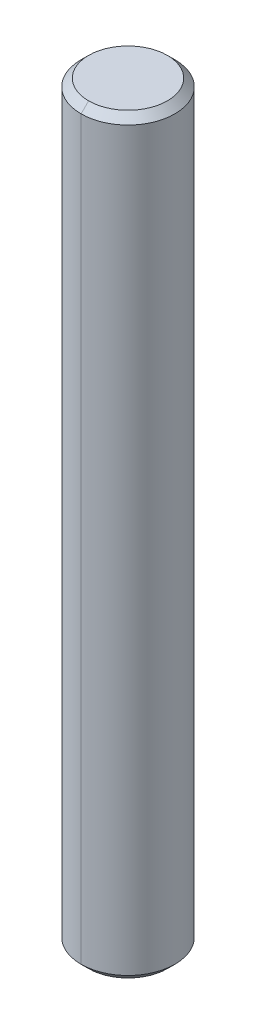
ISO-10303-21;
HEADER;
FILE_DESCRIPTION(('STEP AP214'),'2;1');
FILE_NAME('part.step','',(''),(''),'','','');
FILE_SCHEMA(('AUTOMOTIVE_DESIGN { 1 0 10303 214 1 1 1 1 }'));
ENDSEC;
DATA;
#1=APPLICATION_CONTEXT('core data for automotive mechanical design processes');
#2=APPLICATION_PROTOCOL_DEFINITION('international standard','automotive_design',2000,#1);
#3=PRODUCT_CONTEXT('',#1,'mechanical');
#4=PRODUCT('Part','Part','',(#3));
#5=PRODUCT_RELATED_PRODUCT_CATEGORY('part','',(#4));
#6=PRODUCT_DEFINITION_FORMATION('','',#4);
#7=PRODUCT_DEFINITION_CONTEXT('part definition',#1,'design');
#8=PRODUCT_DEFINITION('design','',#6,#7);
#9=PRODUCT_DEFINITION_SHAPE('','',#8);
#10=(LENGTH_UNIT() NAMED_UNIT(*) SI_UNIT(.MILLI.,.METRE.));
#11=(NAMED_UNIT(*) PLANE_ANGLE_UNIT() SI_UNIT($,.RADIAN.));
#12=(NAMED_UNIT(*) SI_UNIT($,.STERADIAN.) SOLID_ANGLE_UNIT());
#13=UNCERTAINTY_MEASURE_WITH_UNIT(LENGTH_MEASURE(1.E-05),#10,'distance_accuracy_value','');
#14=(GEOMETRIC_REPRESENTATION_CONTEXT(3) GLOBAL_UNCERTAINTY_ASSIGNED_CONTEXT((#13)) GLOBAL_UNIT_ASSIGNED_CONTEXT((#10,
#11,#12)) REPRESENTATION_CONTEXT('',''));
#15=CARTESIAN_POINT('',(0.,0.,0.));
#16=DIRECTION('',(0.,0.,1.));
#17=DIRECTION('',(1.,0.,0.));
#18=AXIS2_PLACEMENT_3D('',#15,#16,#17);
#19=CARTESIAN_POINT('',(0.,50.8,0.));
#20=DIRECTION('',(0.,-1.,0.));
#21=DIRECTION('',(0.,0.,-1.));
#22=AXIS2_PLACEMENT_3D('',#19,#20,#21);
#23=CONICAL_SURFACE('',#22,2.66319,0.785398163397444);
#24=DIRECTION('',(0.,-0.707106781186551,0.707106781186545));
#25=VECTOR('',#24,1.);
#26=CARTESIAN_POINT('',(0.,50.8,2.66319));
#27=LINE('',#26,#25);
#28=CARTESIAN_POINT('',(0.,50.8,2.66319));
#29=VERTEX_POINT('',#28);
#30=CARTESIAN_POINT('',(0.,50.292,3.17119));
#31=VERTEX_POINT('',#30);
#32=EDGE_CURVE('E78',#29,#31,#27,.T.);
#33=ORIENTED_EDGE('',*,*,#32,.F.);
#34=CARTESIAN_POINT('',(0.,50.8,0.));
#35=DIRECTION('',(0.,1.,0.));
#36=DIRECTION('',(0.,0.,1.));
#37=AXIS2_PLACEMENT_3D('',#34,#35,#36);
#38=CIRCLE('',#37,2.66319);
#39=CARTESIAN_POINT('',(0.,50.8,-2.66319));
#40=VERTEX_POINT('',#39);
#41=EDGE_CURVE('E26',#40,#29,#38,.T.);
#42=ORIENTED_EDGE('',*,*,#41,.F.);
#43=DIRECTION('',(0.,-0.707106781186551,-0.707106781186545));
#44=VECTOR('',#43,1.);
#45=CARTESIAN_POINT('',(0.,50.8,-2.66319));
#46=LINE('',#45,#44);
#47=CARTESIAN_POINT('',(0.,50.292,-3.17119));
#48=VERTEX_POINT('',#47);
#49=EDGE_CURVE('E86',#40,#48,#46,.T.);
#50=ORIENTED_EDGE('',*,*,#49,.T.);
#51=CARTESIAN_POINT('',(0.,50.292,0.));
#52=DIRECTION('',(0.,-1.,0.));
#53=DIRECTION('',(0.,0.,1.));
#54=AXIS2_PLACEMENT_3D('',#51,#52,#53);
#55=CIRCLE('',#54,3.17119);
#56=EDGE_CURVE('E79',#31,#48,#55,.T.);
#57=ORIENTED_EDGE('',*,*,#56,.F.);
#58=EDGE_LOOP('',(#33,#42,#50,#57));
#59=FACE_BOUND('',#58,.T.);
#60=ADVANCED_FACE('F15',(#59),#23,.T.);
#61=CARTESIAN_POINT('',(0.,0.508,0.));
#62=DIRECTION('',(0.,1.,0.));
#63=DIRECTION('',(0.,0.,1.));
#64=AXIS2_PLACEMENT_3D('',#61,#62,#63);
#65=CONICAL_SURFACE('',#64,3.17119,0.78539816339745);
#66=DIRECTION('',(0.,0.707106781186546,-0.707106781186549));
#67=VECTOR('',#66,1.);
#68=CARTESIAN_POINT('',(0.,0.508,-3.17119));
#69=LINE('',#68,#67);
#70=CARTESIAN_POINT('',(0.,0.,-2.66319));
#71=VERTEX_POINT('',#70);
#72=CARTESIAN_POINT('',(0.,0.508,-3.17119));
#73=VERTEX_POINT('',#72);
#74=EDGE_CURVE('E102',#71,#73,#69,.T.);
#75=ORIENTED_EDGE('',*,*,#74,.F.);
#76=CARTESIAN_POINT('',(0.,0.,0.));
#77=DIRECTION('',(0.,-1.,0.));
#78=DIRECTION('',(0.,0.,1.));
#79=AXIS2_PLACEMENT_3D('',#76,#77,#78);
#80=CIRCLE('',#79,2.66319);
#81=CARTESIAN_POINT('',(0.,0.,2.66319));
#82=VERTEX_POINT('',#81);
#83=EDGE_CURVE('E10',#82,#71,#80,.T.);
#84=ORIENTED_EDGE('',*,*,#83,.F.);
#85=DIRECTION('',(0.,0.707106781186546,0.707106781186549));
#86=VECTOR('',#85,1.);
#87=CARTESIAN_POINT('',(0.,0.508,3.17119));
#88=LINE('',#87,#86);
#89=CARTESIAN_POINT('',(0.,0.508,3.17119));
#90=VERTEX_POINT('',#89);
#91=EDGE_CURVE('E19',#82,#90,#88,.T.);
#92=ORIENTED_EDGE('',*,*,#91,.T.);
#93=CARTESIAN_POINT('',(0.,0.508,0.));
#94=DIRECTION('',(0.,1.,0.));
#95=DIRECTION('',(0.,0.,1.));
#96=AXIS2_PLACEMENT_3D('',#93,#94,#95);
#97=CIRCLE('',#96,3.17119);
#98=EDGE_CURVE('E40',#73,#90,#97,.T.);
#99=ORIENTED_EDGE('',*,*,#98,.F.);
#100=EDGE_LOOP('',(#75,#84,#92,#99));
#101=FACE_BOUND('',#100,.T.);
#102=ADVANCED_FACE('F138',(#101),#65,.T.);
#103=CARTESIAN_POINT('',(0.,0.,0.));
#104=DIRECTION('',(0.,1.,0.));
#105=DIRECTION('',(1.,0.,0.));
#106=AXIS2_PLACEMENT_3D('',#103,#104,#105);
#107=PLANE('',#106);
#108=ORIENTED_EDGE('',*,*,#83,.T.);
#109=CARTESIAN_POINT('',(0.,0.,0.));
#110=DIRECTION('',(0.,-1.,0.));
#111=DIRECTION('',(0.,0.,1.));
#112=AXIS2_PLACEMENT_3D('',#109,#110,#111);
#113=CIRCLE('',#112,2.66319);
#114=EDGE_CURVE('E98',#71,#82,#113,.T.);
#115=ORIENTED_EDGE('',*,*,#114,.T.);
#116=EDGE_LOOP('',(#108,#115));
#117=FACE_BOUND('',#116,.T.);
#118=ADVANCED_FACE('F133',(#117),#107,.F.);
#119=CARTESIAN_POINT('',(0.,50.8,0.));
#120=DIRECTION('',(0.,1.,0.));
#121=DIRECTION('',(1.,0.,0.));
#122=AXIS2_PLACEMENT_3D('',#119,#120,#121);
#123=PLANE('',#122);
#124=ORIENTED_EDGE('',*,*,#41,.T.);
#125=CARTESIAN_POINT('',(0.,50.8,0.));
#126=DIRECTION('',(0.,1.,0.));
#127=DIRECTION('',(0.,0.,1.));
#128=AXIS2_PLACEMENT_3D('',#125,#126,#127);
#129=CIRCLE('',#128,2.66319);
#130=EDGE_CURVE('E71',#29,#40,#129,.T.);
#131=ORIENTED_EDGE('',*,*,#130,.T.);
#132=EDGE_LOOP('',(#124,#131));
#133=FACE_BOUND('',#132,.T.);
#134=ADVANCED_FACE('F69',(#133),#123,.T.);
#135=CARTESIAN_POINT('',(0.,50.8,0.));
#136=DIRECTION('',(0.,-1.,0.));
#137=DIRECTION('',(0.,0.,-1.));
#138=AXIS2_PLACEMENT_3D('',#135,#136,#137);
#139=CYLINDRICAL_SURFACE('',#138,3.17119);
#140=DIRECTION('',(0.,-1.,0.));
#141=VECTOR('',#140,1.);
#142=CARTESIAN_POINT('',(0.,50.8,3.17119));
#143=LINE('',#142,#141);
#144=EDGE_CURVE('E95',#31,#90,#143,.T.);
#145=ORIENTED_EDGE('',*,*,#144,.F.);
#146=ORIENTED_EDGE('',*,*,#56,.T.);
#147=DIRECTION('',(0.,-1.,0.));
#148=VECTOR('',#147,1.);
#149=CARTESIAN_POINT('',(0.,50.8,-3.17119));
#150=LINE('',#149,#148);
#151=EDGE_CURVE('E92',#48,#73,#150,.T.);
#152=ORIENTED_EDGE('',*,*,#151,.T.);
#153=ORIENTED_EDGE('',*,*,#98,.T.);
#154=EDGE_LOOP('',(#145,#146,#152,#153));
#155=FACE_BOUND('',#154,.T.);
#156=ADVANCED_FACE('F124',(#155),#139,.T.);
#157=CARTESIAN_POINT('',(0.,50.8,0.));
#158=DIRECTION('',(0.,-1.,0.));
#159=DIRECTION('',(0.,0.,-1.));
#160=AXIS2_PLACEMENT_3D('',#157,#158,#159);
#161=CYLINDRICAL_SURFACE('',#160,3.17119);
#162=CARTESIAN_POINT('',(0.,50.292,0.));
#163=DIRECTION('',(0.,-1.,0.));
#164=DIRECTION('',(0.,0.,1.));
#165=AXIS2_PLACEMENT_3D('',#162,#163,#164);
#166=CIRCLE('',#165,3.17119);
#167=EDGE_CURVE('E83',#48,#31,#166,.T.);
#168=ORIENTED_EDGE('',*,*,#167,.T.);
#169=ORIENTED_EDGE('',*,*,#144,.T.);
#170=CARTESIAN_POINT('',(0.,0.508,0.));
#171=DIRECTION('',(0.,1.,0.));
#172=DIRECTION('',(0.,0.,1.));
#173=AXIS2_PLACEMENT_3D('',#170,#171,#172);
#174=CIRCLE('',#173,3.17119);
#175=EDGE_CURVE('E99',#90,#73,#174,.T.);
#176=ORIENTED_EDGE('',*,*,#175,.T.);
#177=ORIENTED_EDGE('',*,*,#151,.F.);
#178=EDGE_LOOP('',(#168,#169,#176,#177));
#179=FACE_BOUND('',#178,.T.);
#180=ADVANCED_FACE('F17',(#179),#161,.T.);
#181=CARTESIAN_POINT('',(0.,0.508,0.));
#182=DIRECTION('',(0.,1.,0.));
#183=DIRECTION('',(0.,0.,1.));
#184=AXIS2_PLACEMENT_3D('',#181,#182,#183);
#185=CONICAL_SURFACE('',#184,3.17119,0.78539816339745);
#186=ORIENTED_EDGE('',*,*,#114,.F.);
#187=ORIENTED_EDGE('',*,*,#74,.T.);
#188=ORIENTED_EDGE('',*,*,#175,.F.);
#189=ORIENTED_EDGE('',*,*,#91,.F.);
#190=EDGE_LOOP('',(#186,#187,#188,#189));
#191=FACE_BOUND('',#190,.T.);
#192=ADVANCED_FACE('F132',(#191),#185,.T.);
#193=CARTESIAN_POINT('',(0.,50.8,0.));
#194=DIRECTION('',(0.,-1.,0.));
#195=DIRECTION('',(0.,0.,-1.));
#196=AXIS2_PLACEMENT_3D('',#193,#194,#195);
#197=CONICAL_SURFACE('',#196,2.66319,0.785398163397444);
#198=ORIENTED_EDGE('',*,*,#130,.F.);
#199=ORIENTED_EDGE('',*,*,#32,.T.);
#200=ORIENTED_EDGE('',*,*,#167,.F.);
#201=ORIENTED_EDGE('',*,*,#49,.F.);
#202=EDGE_LOOP('',(#198,#199,#200,#201));
#203=FACE_BOUND('',#202,.T.);
#204=ADVANCED_FACE('F85',(#203),#197,.T.);
#205=CLOSED_SHELL('',(#60,#102,#118,#134,#156,#180,#192,#204));
#206=MANIFOLD_SOLID_BREP('B1',#205);
#207=ADVANCED_BREP_SHAPE_REPRESENTATION('',(#18,#206),#14);
#208=SHAPE_DEFINITION_REPRESENTATION(#9,#207);
ENDSEC;
END-ISO-10303-21;
